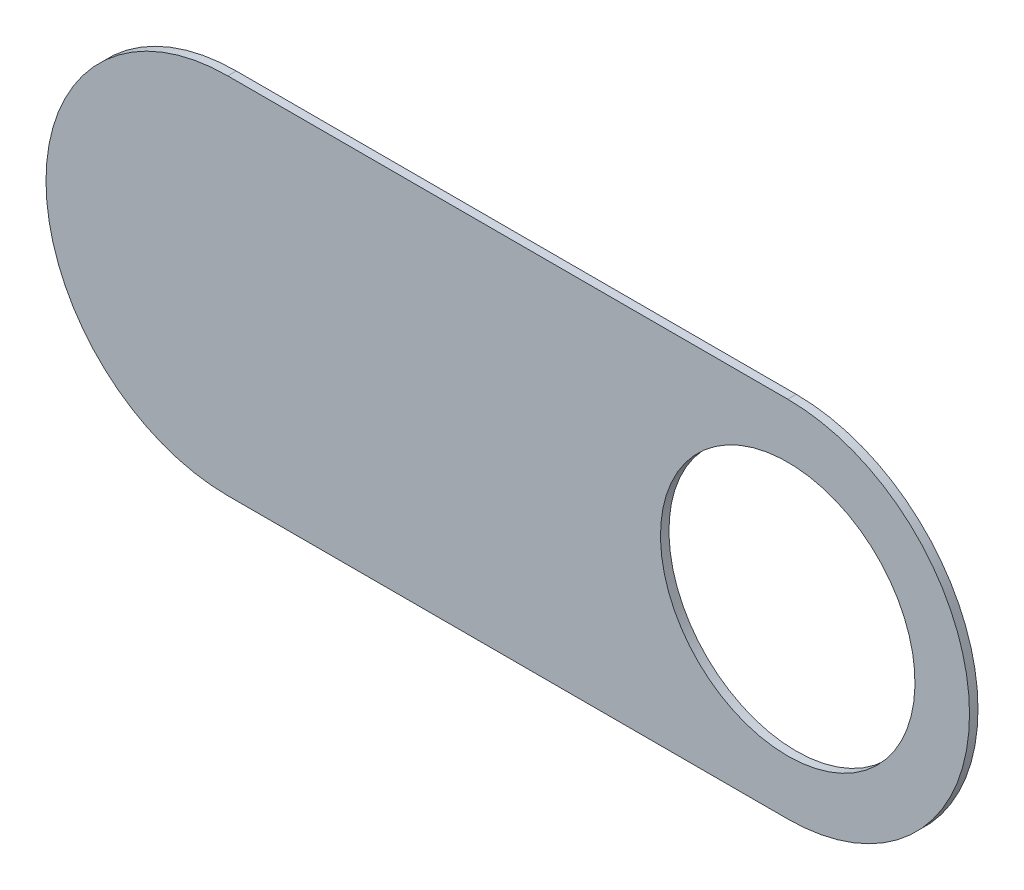
ISO-10303-21;
HEADER;
FILE_DESCRIPTION(('STEP AP214'),'2;1');
FILE_NAME('part.step','',(''),(''),'','','');
FILE_SCHEMA(('AUTOMOTIVE_DESIGN { 1 0 10303 214 1 1 1 1 }'));
ENDSEC;
DATA;
#1=APPLICATION_CONTEXT('core data for automotive mechanical design processes');
#2=APPLICATION_PROTOCOL_DEFINITION('international standard','automotive_design',2000,#1);
#3=PRODUCT_CONTEXT('',#1,'mechanical');
#4=PRODUCT('Part','Part','',(#3));
#5=PRODUCT_RELATED_PRODUCT_CATEGORY('part','',(#4));
#6=PRODUCT_DEFINITION_FORMATION('','',#4);
#7=PRODUCT_DEFINITION_CONTEXT('part definition',#1,'design');
#8=PRODUCT_DEFINITION('design','',#6,#7);
#9=PRODUCT_DEFINITION_SHAPE('','',#8);
#10=(LENGTH_UNIT() NAMED_UNIT(*) SI_UNIT(.MILLI.,.METRE.));
#11=(NAMED_UNIT(*) PLANE_ANGLE_UNIT() SI_UNIT($,.RADIAN.));
#12=(NAMED_UNIT(*) SI_UNIT($,.STERADIAN.) SOLID_ANGLE_UNIT());
#13=UNCERTAINTY_MEASURE_WITH_UNIT(LENGTH_MEASURE(1.E-05),#10,'distance_accuracy_value','');
#14=(GEOMETRIC_REPRESENTATION_CONTEXT(3) GLOBAL_UNCERTAINTY_ASSIGNED_CONTEXT((#13)) GLOBAL_UNIT_ASSIGNED_CONTEXT((#10,
#11,#12)) REPRESENTATION_CONTEXT('',''));
#15=CARTESIAN_POINT('',(0.,0.,0.));
#16=DIRECTION('',(0.,0.,1.));
#17=DIRECTION('',(1.,0.,0.));
#18=AXIS2_PLACEMENT_3D('',#15,#16,#17);
#19=CARTESIAN_POINT('',(158.952,-121.234,-0.045));
#20=DIRECTION('',(0.,0.,-1.));
#21=DIRECTION('',(0.,-1.,0.));
#22=AXIS2_PLACEMENT_3D('',#19,#20,#21);
#23=CYLINDRICAL_SURFACE('',#22,0.525);
#24=CARTESIAN_POINT('',(158.952,-121.234,-0.035));
#25=DIRECTION('',(0.,0.,-1.));
#26=DIRECTION('',(0.,-1.,0.));
#27=AXIS2_PLACEMENT_3D('',#24,#25,#26);
#28=CIRCLE('',#27,0.525);
#29=CARTESIAN_POINT('',(158.952,-121.759,-0.035));
#30=VERTEX_POINT('',#29);
#31=EDGE_CURVE('E122',#30,#30,#28,.T.);
#32=ORIENTED_EDGE('',*,*,#31,.T.);
#33=DIRECTION('',(0.,0.,1.));
#34=VECTOR('',#33,1.);
#35=CARTESIAN_POINT('',(158.952,-121.759,-0.045));
#36=LINE('',#35,#34);
#37=CARTESIAN_POINT('',(158.952,-121.759,0.));
#38=VERTEX_POINT('',#37);
#39=EDGE_CURVE('E11',#30,#38,#36,.T.);
#40=ORIENTED_EDGE('',*,*,#39,.T.);
#41=CARTESIAN_POINT('',(158.952,-121.234,0.));
#42=DIRECTION('',(0.,0.,-1.));
#43=DIRECTION('',(0.,-1.,0.));
#44=AXIS2_PLACEMENT_3D('',#41,#42,#43);
#45=CIRCLE('',#44,0.525);
#46=EDGE_CURVE('E26',#38,#38,#45,.T.);
#47=ORIENTED_EDGE('',*,*,#46,.F.);
#48=ORIENTED_EDGE('',*,*,#39,.F.);
#49=EDGE_LOOP('',(#32,#40,#47,#48));
#50=FACE_BOUND('',#49,.T.);
#51=ADVANCED_FACE('F17',(#50),#23,.F.);
#52=CARTESIAN_POINT('',(156.642,-121.984,-0.035));
#53=DIRECTION('',(0.,1.,0.));
#54=DIRECTION('',(1.,0.,0.));
#55=AXIS2_PLACEMENT_3D('',#52,#53,#54);
#56=PLANE('',#55);
#57=DIRECTION('',(1.,0.,0.));
#58=VECTOR('',#57,1.);
#59=CARTESIAN_POINT('',(156.642,-121.984,-0.035));
#60=LINE('',#59,#58);
#61=CARTESIAN_POINT('',(156.642,-121.984,-0.035));
#62=VERTEX_POINT('',#61);
#63=CARTESIAN_POINT('',(158.952,-121.984,-0.035));
#64=VERTEX_POINT('',#63);
#65=EDGE_CURVE('E125',#62,#64,#60,.T.);
#66=ORIENTED_EDGE('',*,*,#65,.T.);
#67=DIRECTION('',(0.,0.,1.));
#68=VECTOR('',#67,1.);
#69=CARTESIAN_POINT('',(158.952,-121.984,-0.035));
#70=LINE('',#69,#68);
#71=CARTESIAN_POINT('',(158.952,-121.984,0.));
#72=VERTEX_POINT('',#71);
#73=EDGE_CURVE('E84',#64,#72,#70,.T.);
#74=ORIENTED_EDGE('',*,*,#73,.T.);
#75=DIRECTION('',(1.,0.,0.));
#76=VECTOR('',#75,1.);
#77=CARTESIAN_POINT('',(156.642,-121.984,0.));
#78=LINE('',#77,#76);
#79=CARTESIAN_POINT('',(156.642,-121.984,0.));
#80=VERTEX_POINT('',#79);
#81=EDGE_CURVE('E119',#80,#72,#78,.T.);
#82=ORIENTED_EDGE('',*,*,#81,.F.);
#83=DIRECTION('',(0.,0.,1.));
#84=VECTOR('',#83,1.);
#85=CARTESIAN_POINT('',(156.642,-121.984,-0.035));
#86=LINE('',#85,#84);
#87=EDGE_CURVE('E114',#62,#80,#86,.T.);
#88=ORIENTED_EDGE('',*,*,#87,.F.);
#89=EDGE_LOOP('',(#66,#74,#82,#88));
#90=FACE_BOUND('',#89,.T.);
#91=ADVANCED_FACE('F19',(#90),#56,.F.);
#92=CARTESIAN_POINT('',(158.952,-120.484,0.));
#93=DIRECTION('',(0.,0.,1.));
#94=DIRECTION('',(1.,0.,0.));
#95=AXIS2_PLACEMENT_3D('',#92,#93,#94);
#96=PLANE('',#95);
#97=ORIENTED_EDGE('',*,*,#46,.T.);
#98=EDGE_LOOP('',(#97));
#99=FACE_BOUND('',#98,.T.);
#100=DIRECTION('',(-1.,0.,0.));
#101=VECTOR('',#100,1.);
#102=CARTESIAN_POINT('',(158.952,-120.484,0.));
#103=LINE('',#102,#101);
#104=CARTESIAN_POINT('',(158.952,-120.484,0.));
#105=VERTEX_POINT('',#104);
#106=CARTESIAN_POINT('',(156.642,-120.484,0.));
#107=VERTEX_POINT('',#106);
#108=EDGE_CURVE('E96',#105,#107,#103,.T.);
#109=ORIENTED_EDGE('',*,*,#108,.T.);
#110=CARTESIAN_POINT('',(156.642,-121.234,0.));
#111=DIRECTION('',(0.,0.,1.));
#112=DIRECTION('',(0.,1.,0.));
#113=AXIS2_PLACEMENT_3D('',#110,#111,#112);
#114=CIRCLE('',#113,0.75);
#115=EDGE_CURVE('E117',#107,#80,#114,.T.);
#116=ORIENTED_EDGE('',*,*,#115,.T.);
#117=ORIENTED_EDGE('',*,*,#81,.T.);
#118=CARTESIAN_POINT('',(158.952,-121.234,0.));
#119=DIRECTION('',(0.,0.,1.));
#120=DIRECTION('',(0.,-1.,0.));
#121=AXIS2_PLACEMENT_3D('',#118,#119,#120);
#122=CIRCLE('',#121,0.75);
#123=EDGE_CURVE('E88',#72,#105,#122,.T.);
#124=ORIENTED_EDGE('',*,*,#123,.T.);
#125=EDGE_LOOP('',(#109,#116,#117,#124));
#126=FACE_BOUND('',#125,.T.);
#127=ADVANCED_FACE('F144',(#99,#126),#96,.T.);
#128=CARTESIAN_POINT('',(158.952,-120.484,-0.035));
#129=DIRECTION('',(0.,0.,1.));
#130=DIRECTION('',(1.,0.,0.));
#131=AXIS2_PLACEMENT_3D('',#128,#129,#130);
#132=PLANE('',#131);
#133=ORIENTED_EDGE('',*,*,#31,.F.);
#134=EDGE_LOOP('',(#133));
#135=FACE_BOUND('',#134,.T.);
#136=CARTESIAN_POINT('',(158.952,-121.234,-0.035));
#137=DIRECTION('',(0.,0.,1.));
#138=DIRECTION('',(0.,-1.,0.));
#139=AXIS2_PLACEMENT_3D('',#136,#137,#138);
#140=CIRCLE('',#139,0.75);
#141=CARTESIAN_POINT('',(158.952,-120.484,-0.035));
#142=VERTEX_POINT('',#141);
#143=EDGE_CURVE('E77',#64,#142,#140,.T.);
#144=ORIENTED_EDGE('',*,*,#143,.F.);
#145=ORIENTED_EDGE('',*,*,#65,.F.);
#146=CARTESIAN_POINT('',(156.642,-121.234,-0.035));
#147=DIRECTION('',(0.,0.,1.));
#148=DIRECTION('',(0.,1.,0.));
#149=AXIS2_PLACEMENT_3D('',#146,#147,#148);
#150=CIRCLE('',#149,0.75);
#151=CARTESIAN_POINT('',(156.642,-120.484,-0.035));
#152=VERTEX_POINT('',#151);
#153=EDGE_CURVE('E101',#152,#62,#150,.T.);
#154=ORIENTED_EDGE('',*,*,#153,.F.);
#155=DIRECTION('',(-1.,0.,0.));
#156=VECTOR('',#155,1.);
#157=CARTESIAN_POINT('',(158.952,-120.484,-0.035));
#158=LINE('',#157,#156);
#159=EDGE_CURVE('E94',#142,#152,#158,.T.);
#160=ORIENTED_EDGE('',*,*,#159,.F.);
#161=EDGE_LOOP('',(#144,#145,#154,#160));
#162=FACE_BOUND('',#161,.T.);
#163=ADVANCED_FACE('F99',(#135,#162),#132,.F.);
#164=CARTESIAN_POINT('',(156.642,-121.234,-0.035));
#165=DIRECTION('',(0.,0.,-1.));
#166=DIRECTION('',(0.,1.,0.));
#167=AXIS2_PLACEMENT_3D('',#164,#165,#166);
#168=CYLINDRICAL_SURFACE('',#167,0.75);
#169=ORIENTED_EDGE('',*,*,#153,.T.);
#170=ORIENTED_EDGE('',*,*,#87,.T.);
#171=ORIENTED_EDGE('',*,*,#115,.F.);
#172=DIRECTION('',(0.,0.,1.));
#173=VECTOR('',#172,1.);
#174=CARTESIAN_POINT('',(156.642,-120.484,-0.035));
#175=LINE('',#174,#173);
#176=EDGE_CURVE('E104',#152,#107,#175,.T.);
#177=ORIENTED_EDGE('',*,*,#176,.F.);
#178=EDGE_LOOP('',(#169,#170,#171,#177));
#179=FACE_BOUND('',#178,.T.);
#180=ADVANCED_FACE('F142',(#179),#168,.T.);
#181=CARTESIAN_POINT('',(158.952,-121.234,-0.035));
#182=DIRECTION('',(0.,0.,-1.));
#183=DIRECTION('',(0.,-1.,0.));
#184=AXIS2_PLACEMENT_3D('',#181,#182,#183);
#185=CYLINDRICAL_SURFACE('',#184,0.75);
#186=ORIENTED_EDGE('',*,*,#143,.T.);
#187=DIRECTION('',(0.,0.,1.));
#188=VECTOR('',#187,1.);
#189=CARTESIAN_POINT('',(158.952,-120.484,-0.035));
#190=LINE('',#189,#188);
#191=EDGE_CURVE('E81',#142,#105,#190,.T.);
#192=ORIENTED_EDGE('',*,*,#191,.T.);
#193=ORIENTED_EDGE('',*,*,#123,.F.);
#194=ORIENTED_EDGE('',*,*,#73,.F.);
#195=EDGE_LOOP('',(#186,#192,#193,#194));
#196=FACE_BOUND('',#195,.T.);
#197=ADVANCED_FACE('F79',(#196),#185,.T.);
#198=CARTESIAN_POINT('',(158.952,-120.484,-0.035));
#199=DIRECTION('',(0.,-1.,0.));
#200=DIRECTION('',(0.,0.,-1.));
#201=AXIS2_PLACEMENT_3D('',#198,#199,#200);
#202=PLANE('',#201);
#203=ORIENTED_EDGE('',*,*,#159,.T.);
#204=ORIENTED_EDGE('',*,*,#176,.T.);
#205=ORIENTED_EDGE('',*,*,#108,.F.);
#206=ORIENTED_EDGE('',*,*,#191,.F.);
#207=EDGE_LOOP('',(#203,#204,#205,#206));
#208=FACE_BOUND('',#207,.T.);
#209=ADVANCED_FACE('F92',(#208),#202,.F.);
#210=CLOSED_SHELL('',(#51,#91,#127,#163,#180,#197,#209));
#211=MANIFOLD_SOLID_BREP('B1',#210);
#212=ADVANCED_BREP_SHAPE_REPRESENTATION('',(#18,#211),#14);
#213=SHAPE_DEFINITION_REPRESENTATION(#9,#212);
ENDSEC;
END-ISO-10303-21;
